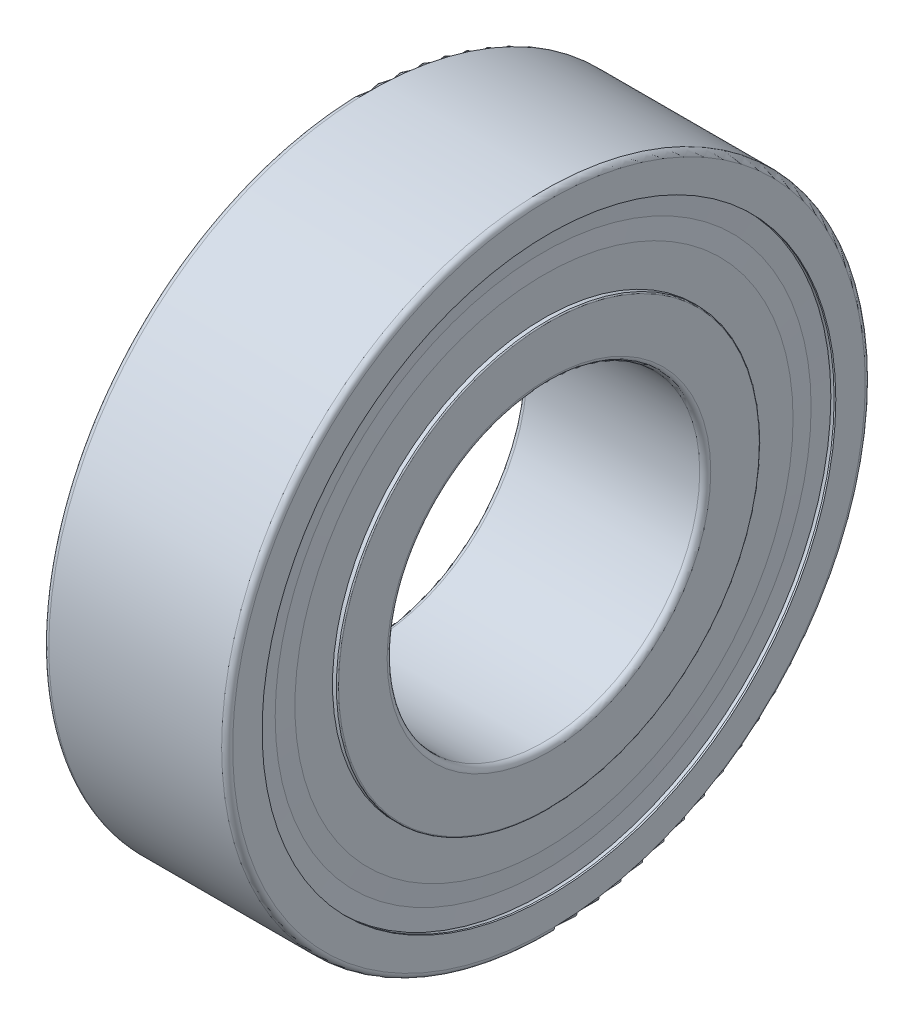
ISO-10303-21;
HEADER;
FILE_DESCRIPTION(('STEP AP214'),'2;1');
FILE_NAME('part.step','',(''),(''),'','','');
FILE_SCHEMA(('AUTOMOTIVE_DESIGN { 1 0 10303 214 1 1 1 1 }'));
ENDSEC;
DATA;
#1=APPLICATION_CONTEXT('core data for automotive mechanical design processes');
#2=APPLICATION_PROTOCOL_DEFINITION('international standard','automotive_design',2000,#1);
#3=PRODUCT_CONTEXT('',#1,'mechanical');
#4=PRODUCT('Part','Part','',(#3));
#5=PRODUCT_RELATED_PRODUCT_CATEGORY('part','',(#4));
#6=PRODUCT_DEFINITION_FORMATION('','',#4);
#7=PRODUCT_DEFINITION_CONTEXT('part definition',#1,'design');
#8=PRODUCT_DEFINITION('design','',#6,#7);
#9=PRODUCT_DEFINITION_SHAPE('','',#8);
#10=(LENGTH_UNIT() NAMED_UNIT(*) SI_UNIT(.MILLI.,.METRE.));
#11=(NAMED_UNIT(*) PLANE_ANGLE_UNIT() SI_UNIT($,.RADIAN.));
#12=(NAMED_UNIT(*) SI_UNIT($,.STERADIAN.) SOLID_ANGLE_UNIT());
#13=UNCERTAINTY_MEASURE_WITH_UNIT(LENGTH_MEASURE(1.E-05),#10,'distance_accuracy_value','');
#14=(GEOMETRIC_REPRESENTATION_CONTEXT(3) GLOBAL_UNCERTAINTY_ASSIGNED_CONTEXT((#13)) GLOBAL_UNIT_ASSIGNED_CONTEXT((#10,
#11,#12)) REPRESENTATION_CONTEXT('',''));
#15=CARTESIAN_POINT('',(0.,0.,0.));
#16=DIRECTION('',(0.,0.,1.));
#17=DIRECTION('',(1.,0.,0.));
#18=AXIS2_PLACEMENT_3D('',#15,#16,#17);
#19=CARTESIAN_POINT('',(50.,0.,0.));
#20=DIRECTION('',(1.,0.,0.));
#21=DIRECTION('',(0.,0.,-1.));
#22=AXIS2_PLACEMENT_3D('',#19,#20,#21);
#23=CYLINDRICAL_SURFACE('',#22,15.6);
#24=CARTESIAN_POINT('',(9.73,0.,0.));
#25=DIRECTION('',(1.,0.,0.));
#26=DIRECTION('',(0.,0.,-1.));
#27=AXIS2_PLACEMENT_3D('',#24,#25,#26);
#28=CIRCLE('',#27,15.6);
#29=CARTESIAN_POINT('',(9.73,0.,-15.6));
#30=VERTEX_POINT('',#29);
#31=EDGE_CURVE('P0_E10',#30,#30,#28,.T.);
#32=ORIENTED_EDGE('',*,*,#31,.F.);
#33=EDGE_LOOP('',(#32));
#34=FACE_BOUND('',#33,.T.);
#35=CARTESIAN_POINT('',(9.64,0.,0.));
#36=DIRECTION('',(1.,0.,0.));
#37=DIRECTION('',(0.,0.,-1.));
#38=AXIS2_PLACEMENT_3D('',#35,#36,#37);
#39=CIRCLE('',#38,15.6);
#40=CARTESIAN_POINT('',(9.64,0.,-15.6));
#41=VERTEX_POINT('',#40);
#42=EDGE_CURVE('P0_E167',#41,#41,#39,.T.);
#43=ORIENTED_EDGE('',*,*,#42,.T.);
#44=EDGE_LOOP('',(#43));
#45=FACE_BOUND('',#44,.T.);
#46=ADVANCED_FACE('P0_F16',(#34,#45),#23,.T.);
#47=CARTESIAN_POINT('',(9.685,0.,0.));
#48=DIRECTION('',(1.,0.,0.));
#49=DIRECTION('',(0.,0.,-1.));
#50=AXIS2_PLACEMENT_3D('',#47,#48,#49);
#51=CONICAL_SURFACE('',#50,14.5725,1.52702867499964);
#52=CARTESIAN_POINT('',(9.685,0.,0.));
#53=DIRECTION('',(1.,0.,0.));
#54=DIRECTION('',(0.,0.,-1.));
#55=AXIS2_PLACEMENT_3D('',#52,#53,#54);
#56=CIRCLE('',#55,14.5725);
#57=CARTESIAN_POINT('',(9.685,0.,-14.5725));
#58=VERTEX_POINT('',#57);
#59=EDGE_CURVE('P0_E26',#58,#58,#56,.T.);
#60=ORIENTED_EDGE('',*,*,#59,.F.);
#61=EDGE_LOOP('',(#60));
#62=FACE_BOUND('',#61,.T.);
#63=ORIENTED_EDGE('',*,*,#31,.T.);
#64=EDGE_LOOP('',(#63));
#65=FACE_BOUND('',#64,.T.);
#66=ADVANCED_FACE('P0_F204',(#62,#65),#51,.F.);
#67=CARTESIAN_POINT('',(9.73,0.,0.));
#68=DIRECTION('',(-1.,0.,0.));
#69=DIRECTION('',(0.,0.,1.));
#70=AXIS2_PLACEMENT_3D('',#67,#68,#69);
#71=CONICAL_SURFACE('',#70,13.545,1.52702867499964);
#72=CARTESIAN_POINT('',(9.73,0.,0.));
#73=DIRECTION('',(1.,0.,0.));
#74=DIRECTION('',(0.,0.,-1.));
#75=AXIS2_PLACEMENT_3D('',#72,#73,#74);
#76=CIRCLE('',#75,13.545);
#77=CARTESIAN_POINT('',(9.73,0.,-13.545));
#78=VERTEX_POINT('',#77);
#79=EDGE_CURVE('P0_E143',#78,#78,#76,.T.);
#80=ORIENTED_EDGE('',*,*,#79,.F.);
#81=EDGE_LOOP('',(#80));
#82=FACE_BOUND('',#81,.T.);
#83=ORIENTED_EDGE('',*,*,#59,.T.);
#84=EDGE_LOOP('',(#83));
#85=FACE_BOUND('',#84,.T.);
#86=ADVANCED_FACE('P0_F201',(#82,#85),#71,.T.);
#87=CARTESIAN_POINT('',(9.73,11.49,0.));
#88=DIRECTION('',(1.,0.,0.));
#89=DIRECTION('',(0.,1.,0.));
#90=AXIS2_PLACEMENT_3D('',#87,#88,#89);
#91=PLANE('',#90);
#92=CARTESIAN_POINT('',(9.73,0.,0.));
#93=DIRECTION('',(-1.,0.,0.));
#94=DIRECTION('',(0.,0.,-1.));
#95=AXIS2_PLACEMENT_3D('',#92,#93,#94);
#96=CIRCLE('',#95,11.5);
#97=CARTESIAN_POINT('',(9.73,0.,-11.5));
#98=VERTEX_POINT('',#97);
#99=EDGE_CURVE('P0_E148',#98,#98,#96,.T.);
#100=ORIENTED_EDGE('',*,*,#99,.T.);
#101=EDGE_LOOP('',(#100));
#102=FACE_BOUND('',#101,.T.);
#103=ORIENTED_EDGE('',*,*,#79,.T.);
#104=EDGE_LOOP('',(#103));
#105=FACE_BOUND('',#104,.T.);
#106=ADVANCED_FACE('P0_F199',(#102,#105),#91,.T.);
#107=CARTESIAN_POINT('',(9.55,0.,0.));
#108=DIRECTION('',(-1.,0.,0.));
#109=DIRECTION('',(0.,0.,1.));
#110=AXIS2_PLACEMENT_3D('',#107,#108,#109);
#111=CONICAL_SURFACE('',#110,13.545,1.52702867499964);
#112=CARTESIAN_POINT('',(9.55,0.,0.));
#113=DIRECTION('',(1.,0.,0.));
#114=DIRECTION('',(0.,0.,-1.));
#115=AXIS2_PLACEMENT_3D('',#112,#113,#114);
#116=CIRCLE('',#115,13.545);
#117=CARTESIAN_POINT('',(9.55,0.,-13.545));
#118=VERTEX_POINT('',#117);
#119=EDGE_CURVE('P0_E170',#118,#118,#116,.T.);
#120=ORIENTED_EDGE('',*,*,#119,.F.);
#121=EDGE_LOOP('',(#120));
#122=FACE_BOUND('',#121,.T.);
#123=CARTESIAN_POINT('',(9.63956204379562,0.,0.));
#124=DIRECTION('',(1.,0.,0.));
#125=DIRECTION('',(0.,0.,1.));
#126=AXIS2_PLACEMENT_3D('',#123,#124,#125);
#127=CIRCLE('',#126,11.5);
#128=CARTESIAN_POINT('',(9.63956204379562,0.,11.5));
#129=VERTEX_POINT('',#128);
#130=EDGE_CURVE('P0_E124',#129,#129,#127,.T.);
#131=ORIENTED_EDGE('',*,*,#130,.T.);
#132=EDGE_LOOP('',(#131));
#133=FACE_BOUND('',#132,.T.);
#134=ADVANCED_FACE('P0_F18',(#122,#133),#111,.F.);
#135=CARTESIAN_POINT('',(9.55,14.5725,0.));
#136=DIRECTION('',(-1.,0.,0.));
#137=DIRECTION('',(0.,0.,1.));
#138=AXIS2_PLACEMENT_3D('',#135,#136,#137);
#139=PLANE('',#138);
#140=CARTESIAN_POINT('',(9.55,0.,0.));
#141=DIRECTION('',(1.,0.,0.));
#142=DIRECTION('',(0.,0.,-1.));
#143=AXIS2_PLACEMENT_3D('',#140,#141,#142);
#144=CIRCLE('',#143,14.5725);
#145=CARTESIAN_POINT('',(9.55,0.,-14.5725));
#146=VERTEX_POINT('',#145);
#147=EDGE_CURVE('P0_E166',#146,#146,#144,.T.);
#148=ORIENTED_EDGE('',*,*,#147,.F.);
#149=EDGE_LOOP('',(#148));
#150=FACE_BOUND('',#149,.T.);
#151=ORIENTED_EDGE('',*,*,#119,.T.);
#152=EDGE_LOOP('',(#151));
#153=FACE_BOUND('',#152,.T.);
#154=ADVANCED_FACE('P0_F246',(#150,#153),#139,.T.);
#155=CARTESIAN_POINT('',(9.64,0.,0.));
#156=DIRECTION('',(1.,0.,0.));
#157=DIRECTION('',(0.,0.,-1.));
#158=AXIS2_PLACEMENT_3D('',#155,#156,#157);
#159=CONICAL_SURFACE('',#158,15.6,1.48342806694239);
#160=ORIENTED_EDGE('',*,*,#42,.F.);
#161=EDGE_LOOP('',(#160));
#162=FACE_BOUND('',#161,.T.);
#163=ORIENTED_EDGE('',*,*,#147,.T.);
#164=EDGE_LOOP('',(#163));
#165=FACE_BOUND('',#164,.T.);
#166=ADVANCED_FACE('P0_F248',(#162,#165),#159,.T.);
#167=CARTESIAN_POINT('',(0.45,0.,0.));
#168=DIRECTION('',(-1.,0.,0.));
#169=DIRECTION('',(0.,0.,1.));
#170=AXIS2_PLACEMENT_3D('',#167,#168,#169);
#171=CONICAL_SURFACE('',#170,14.5725,1.48342806694239);
#172=CARTESIAN_POINT('',(0.45,0.,0.));
#173=DIRECTION('',(1.,0.,0.));
#174=DIRECTION('',(0.,0.,-1.));
#175=AXIS2_PLACEMENT_3D('',#172,#173,#174);
#176=CIRCLE('',#175,14.5725);
#177=CARTESIAN_POINT('',(0.45,0.,-14.5725));
#178=VERTEX_POINT('',#177);
#179=EDGE_CURVE('P0_E163',#178,#178,#176,.T.);
#180=ORIENTED_EDGE('',*,*,#179,.F.);
#181=EDGE_LOOP('',(#180));
#182=FACE_BOUND('',#181,.T.);
#183=CARTESIAN_POINT('',(0.36,0.,0.));
#184=DIRECTION('',(1.,0.,0.));
#185=DIRECTION('',(0.,0.,-1.));
#186=AXIS2_PLACEMENT_3D('',#183,#184,#185);
#187=CIRCLE('',#186,15.6);
#188=CARTESIAN_POINT('',(0.36,0.,-15.6));
#189=VERTEX_POINT('',#188);
#190=EDGE_CURVE('P0_E140',#189,#189,#187,.T.);
#191=ORIENTED_EDGE('',*,*,#190,.T.);
#192=EDGE_LOOP('',(#191));
#193=FACE_BOUND('',#192,.T.);
#194=ADVANCED_FACE('P0_F254',(#182,#193),#171,.T.);
#195=CARTESIAN_POINT('',(0.45,13.545,0.));
#196=DIRECTION('',(1.,0.,0.));
#197=DIRECTION('',(0.,1.,0.));
#198=AXIS2_PLACEMENT_3D('',#195,#196,#197);
#199=PLANE('',#198);
#200=CARTESIAN_POINT('',(0.45,0.,0.));
#201=DIRECTION('',(1.,0.,0.));
#202=DIRECTION('',(0.,0.,-1.));
#203=AXIS2_PLACEMENT_3D('',#200,#201,#202);
#204=CIRCLE('',#203,13.545);
#205=CARTESIAN_POINT('',(0.45,0.,-13.545));
#206=VERTEX_POINT('',#205);
#207=EDGE_CURVE('P0_E156',#206,#206,#204,.T.);
#208=ORIENTED_EDGE('',*,*,#207,.F.);
#209=EDGE_LOOP('',(#208));
#210=FACE_BOUND('',#209,.T.);
#211=ORIENTED_EDGE('',*,*,#179,.T.);
#212=EDGE_LOOP('',(#211));
#213=FACE_BOUND('',#212,.T.);
#214=ADVANCED_FACE('P0_F251',(#210,#213),#199,.T.);
#215=CARTESIAN_POINT('',(0.36,0.,0.));
#216=DIRECTION('',(1.,0.,0.));
#217=DIRECTION('',(0.,0.,-1.));
#218=AXIS2_PLACEMENT_3D('',#215,#216,#217);
#219=CONICAL_SURFACE('',#218,11.49,1.52702867499964);
#220=CARTESIAN_POINT('',(0.360437956204379,0.,0.));
#221=DIRECTION('',(-1.,0.,0.));
#222=DIRECTION('',(0.,0.,-1.));
#223=AXIS2_PLACEMENT_3D('',#220,#221,#222);
#224=CIRCLE('',#223,11.5);
#225=CARTESIAN_POINT('',(0.360437956204379,0.,-11.5));
#226=VERTEX_POINT('',#225);
#227=EDGE_CURVE('P0_E147',#226,#226,#224,.T.);
#228=ORIENTED_EDGE('',*,*,#227,.T.);
#229=EDGE_LOOP('',(#228));
#230=FACE_BOUND('',#229,.T.);
#231=ORIENTED_EDGE('',*,*,#207,.T.);
#232=EDGE_LOOP('',(#231));
#233=FACE_BOUND('',#232,.T.);
#234=ADVANCED_FACE('P0_F233',(#230,#233),#219,.F.);
#235=CARTESIAN_POINT('',(0.27,13.545,0.));
#236=DIRECTION('',(-1.,0.,0.));
#237=DIRECTION('',(0.,0.,1.));
#238=AXIS2_PLACEMENT_3D('',#235,#236,#237);
#239=PLANE('',#238);
#240=CARTESIAN_POINT('',(0.27,0.,0.));
#241=DIRECTION('',(1.,0.,0.));
#242=DIRECTION('',(0.,0.,-1.));
#243=AXIS2_PLACEMENT_3D('',#240,#241,#242);
#244=CIRCLE('',#243,13.545);
#245=CARTESIAN_POINT('',(0.27,0.,-13.545));
#246=VERTEX_POINT('',#245);
#247=EDGE_CURVE('P0_E139',#246,#246,#244,.T.);
#248=ORIENTED_EDGE('',*,*,#247,.F.);
#249=EDGE_LOOP('',(#248));
#250=FACE_BOUND('',#249,.T.);
#251=CARTESIAN_POINT('',(0.27,0.,0.));
#252=DIRECTION('',(1.,0.,0.));
#253=DIRECTION('',(0.,0.,1.));
#254=AXIS2_PLACEMENT_3D('',#251,#252,#253);
#255=CIRCLE('',#254,11.5);
#256=CARTESIAN_POINT('',(0.27,0.,11.5));
#257=VERTEX_POINT('',#256);
#258=EDGE_CURVE('P0_E149',#257,#257,#255,.T.);
#259=ORIENTED_EDGE('',*,*,#258,.T.);
#260=EDGE_LOOP('',(#259));
#261=FACE_BOUND('',#260,.T.);
#262=ADVANCED_FACE('P0_F229',(#250,#261),#239,.T.);
#263=CARTESIAN_POINT('',(0.315,0.,0.));
#264=DIRECTION('',(1.,0.,0.));
#265=DIRECTION('',(0.,0.,-1.));
#266=AXIS2_PLACEMENT_3D('',#263,#264,#265);
#267=CONICAL_SURFACE('',#266,14.5725,1.52702867499964);
#268=CARTESIAN_POINT('',(0.315,0.,0.));
#269=DIRECTION('',(1.,0.,0.));
#270=DIRECTION('',(0.,0.,-1.));
#271=AXIS2_PLACEMENT_3D('',#268,#269,#270);
#272=CIRCLE('',#271,14.5725);
#273=CARTESIAN_POINT('',(0.315,0.,-14.5725));
#274=VERTEX_POINT('',#273);
#275=EDGE_CURVE('P0_E136',#274,#274,#272,.T.);
#276=ORIENTED_EDGE('',*,*,#275,.F.);
#277=EDGE_LOOP('',(#276));
#278=FACE_BOUND('',#277,.T.);
#279=ORIENTED_EDGE('',*,*,#247,.T.);
#280=EDGE_LOOP('',(#279));
#281=FACE_BOUND('',#280,.T.);
#282=ADVANCED_FACE('P0_F232',(#278,#281),#267,.T.);
#283=CARTESIAN_POINT('',(0.27,0.,0.));
#284=DIRECTION('',(-1.,0.,0.));
#285=DIRECTION('',(0.,0.,1.));
#286=AXIS2_PLACEMENT_3D('',#283,#284,#285);
#287=CONICAL_SURFACE('',#286,15.6,1.52702867499964);
#288=CARTESIAN_POINT('',(0.27,0.,0.));
#289=DIRECTION('',(1.,0.,0.));
#290=DIRECTION('',(0.,0.,-1.));
#291=AXIS2_PLACEMENT_3D('',#288,#289,#290);
#292=CIRCLE('',#291,15.6);
#293=CARTESIAN_POINT('',(0.27,0.,-15.6));
#294=VERTEX_POINT('',#293);
#295=EDGE_CURVE('P0_E184',#294,#294,#292,.T.);
#296=ORIENTED_EDGE('',*,*,#295,.F.);
#297=EDGE_LOOP('',(#296));
#298=FACE_BOUND('',#297,.T.);
#299=ORIENTED_EDGE('',*,*,#275,.T.);
#300=EDGE_LOOP('',(#299));
#301=FACE_BOUND('',#300,.T.);
#302=ADVANCED_FACE('P0_F244',(#298,#301),#287,.F.);
#303=CARTESIAN_POINT('',(50.,0.,0.));
#304=DIRECTION('',(1.,0.,0.));
#305=DIRECTION('',(0.,0.,-1.));
#306=AXIS2_PLACEMENT_3D('',#303,#304,#305);
#307=CYLINDRICAL_SURFACE('',#306,15.6);
#308=ORIENTED_EDGE('',*,*,#190,.F.);
#309=EDGE_LOOP('',(#308));
#310=FACE_BOUND('',#309,.T.);
#311=ORIENTED_EDGE('',*,*,#295,.T.);
#312=EDGE_LOOP('',(#311));
#313=FACE_BOUND('',#312,.T.);
#314=ADVANCED_FACE('P0_F273',(#310,#313),#307,.T.);
#315=CARTESIAN_POINT('',(50.,0.,0.));
#316=DIRECTION('',(1.,0.,0.));
#317=DIRECTION('',(0.,0.,-1.));
#318=AXIS2_PLACEMENT_3D('',#315,#316,#317);
#319=CYLINDRICAL_SURFACE('',#318,11.5);
#320=CARTESIAN_POINT('',(3.15090265264373,0.,0.));
#321=DIRECTION('',(1.,0.,0.));
#322=DIRECTION('',(0.,0.,-1.));
#323=AXIS2_PLACEMENT_3D('',#320,#321,#322);
#324=CIRCLE('',#323,11.5);
#325=CARTESIAN_POINT('',(3.15090265264373,0.,-11.5));
#326=VERTEX_POINT('',#325);
#327=EDGE_CURVE('P0_E144',#326,#326,#324,.T.);
#328=ORIENTED_EDGE('',*,*,#327,.F.);
#329=EDGE_LOOP('',(#328));
#330=FACE_BOUND('',#329,.T.);
#331=ORIENTED_EDGE('',*,*,#227,.F.);
#332=EDGE_LOOP('',(#331));
#333=FACE_BOUND('',#332,.T.);
#334=ADVANCED_FACE('P0_F275',(#330,#333),#319,.T.);
#335=CARTESIAN_POINT('',(5.,0.,0.));
#336=DIRECTION('',(1.,0.,0.));
#337=DIRECTION('',(0.,0.,-1.));
#338=AXIS2_PLACEMENT_3D('',#335,#336,#337);
#339=TOROIDAL_SURFACE('',#338,13.,2.381);
#340=ORIENTED_EDGE('',*,*,#327,.T.);
#341=EDGE_LOOP('',(#340));
#342=FACE_BOUND('',#341,.T.);
#343=CARTESIAN_POINT('',(6.84909734735627,0.,0.));
#344=DIRECTION('',(1.,0.,0.));
#345=DIRECTION('',(0.,0.,-1.));
#346=AXIS2_PLACEMENT_3D('',#343,#344,#345);
#347=CIRCLE('',#346,11.5);
#348=CARTESIAN_POINT('',(6.84909734735627,0.,-11.5));
#349=VERTEX_POINT('',#348);
#350=EDGE_CURVE('P0_E120',#349,#349,#347,.T.);
#351=ORIENTED_EDGE('',*,*,#350,.F.);
#352=EDGE_LOOP('',(#351));
#353=FACE_BOUND('',#352,.T.);
#354=ADVANCED_FACE('P0_F271',(#342,#353),#339,.F.);
#355=CARTESIAN_POINT('',(50.,0.,0.));
#356=DIRECTION('',(1.,0.,0.));
#357=DIRECTION('',(0.,0.,-1.));
#358=AXIS2_PLACEMENT_3D('',#355,#356,#357);
#359=CYLINDRICAL_SURFACE('',#358,11.5);
#360=CARTESIAN_POINT('',(9.94,0.,0.));
#361=DIRECTION('',(1.,0.,0.));
#362=DIRECTION('',(0.,0.,-1.));
#363=AXIS2_PLACEMENT_3D('',#360,#361,#362);
#364=CIRCLE('',#363,11.5);
#365=CARTESIAN_POINT('',(9.94,0.,-11.5));
#366=VERTEX_POINT('',#365);
#367=EDGE_CURVE('P0_E174',#366,#366,#364,.T.);
#368=ORIENTED_EDGE('',*,*,#367,.F.);
#369=EDGE_LOOP('',(#368));
#370=FACE_BOUND('',#369,.T.);
#371=ORIENTED_EDGE('',*,*,#99,.F.);
#372=EDGE_LOOP('',(#371));
#373=FACE_BOUND('',#372,.T.);
#374=ADVANCED_FACE('P0_F237',(#370,#373),#359,.T.);
#375=CARTESIAN_POINT('',(9.94,0.,0.));
#376=DIRECTION('',(1.,0.,0.));
#377=DIRECTION('',(0.,0.,-1.));
#378=AXIS2_PLACEMENT_3D('',#375,#376,#377);
#379=TOROIDAL_SURFACE('',#378,11.44,0.0599999999999976);
#380=CARTESIAN_POINT('',(10.,0.,0.));
#381=DIRECTION('',(1.,0.,0.));
#382=DIRECTION('',(0.,0.,-1.));
#383=AXIS2_PLACEMENT_3D('',#380,#381,#382);
#384=CIRCLE('',#383,11.44);
#385=CARTESIAN_POINT('',(10.,0.,-11.44));
#386=VERTEX_POINT('',#385);
#387=EDGE_CURVE('P0_E161',#386,#386,#384,.T.);
#388=ORIENTED_EDGE('',*,*,#387,.F.);
#389=EDGE_LOOP('',(#388));
#390=FACE_BOUND('',#389,.T.);
#391=ORIENTED_EDGE('',*,*,#367,.T.);
#392=EDGE_LOOP('',(#391));
#393=FACE_BOUND('',#392,.T.);
#394=ADVANCED_FACE('P0_F221',(#390,#393),#379,.T.);
#395=CARTESIAN_POINT('',(10.,8.8,0.));
#396=DIRECTION('',(1.,0.,0.));
#397=DIRECTION('',(0.,1.,0.));
#398=AXIS2_PLACEMENT_3D('',#395,#396,#397);
#399=PLANE('',#398);
#400=CARTESIAN_POINT('',(10.,0.,0.));
#401=DIRECTION('',(1.,0.,0.));
#402=DIRECTION('',(0.,0.,-1.));
#403=AXIS2_PLACEMENT_3D('',#400,#401,#402);
#404=CIRCLE('',#403,8.8);
#405=CARTESIAN_POINT('',(10.,0.,-8.8));
#406=VERTEX_POINT('',#405);
#407=EDGE_CURVE('P0_E157',#406,#406,#404,.T.);
#408=ORIENTED_EDGE('',*,*,#407,.F.);
#409=EDGE_LOOP('',(#408));
#410=FACE_BOUND('',#409,.T.);
#411=ORIENTED_EDGE('',*,*,#387,.T.);
#412=EDGE_LOOP('',(#411));
#413=FACE_BOUND('',#412,.T.);
#414=ADVANCED_FACE('P0_F217',(#410,#413),#399,.T.);
#415=CARTESIAN_POINT('',(9.7,0.,0.));
#416=DIRECTION('',(1.,0.,0.));
#417=DIRECTION('',(0.,0.,-1.));
#418=AXIS2_PLACEMENT_3D('',#415,#416,#417);
#419=TOROIDAL_SURFACE('',#418,8.8,0.300000000000005);
#420=CARTESIAN_POINT('',(9.7,0.,0.));
#421=DIRECTION('',(1.,0.,0.));
#422=DIRECTION('',(0.,0.,-1.));
#423=AXIS2_PLACEMENT_3D('',#420,#421,#422);
#424=CIRCLE('',#423,8.5);
#425=CARTESIAN_POINT('',(9.7,0.,-8.5));
#426=VERTEX_POINT('',#425);
#427=EDGE_CURVE('P0_E162',#426,#426,#424,.T.);
#428=ORIENTED_EDGE('',*,*,#427,.F.);
#429=EDGE_LOOP('',(#428));
#430=FACE_BOUND('',#429,.T.);
#431=ORIENTED_EDGE('',*,*,#407,.T.);
#432=EDGE_LOOP('',(#431));
#433=FACE_BOUND('',#432,.T.);
#434=ADVANCED_FACE('P0_F220',(#430,#433),#419,.T.);
#435=CARTESIAN_POINT('',(50.,0.,0.));
#436=DIRECTION('',(1.,0.,0.));
#437=DIRECTION('',(0.,0.,-1.));
#438=AXIS2_PLACEMENT_3D('',#435,#436,#437);
#439=CYLINDRICAL_SURFACE('',#438,8.5);
#440=CARTESIAN_POINT('',(0.3,0.,0.));
#441=DIRECTION('',(1.,0.,0.));
#442=DIRECTION('',(0.,0.,-1.));
#443=AXIS2_PLACEMENT_3D('',#440,#441,#442);
#444=CIRCLE('',#443,8.5);
#445=CARTESIAN_POINT('',(0.3,0.,-8.5));
#446=VERTEX_POINT('',#445);
#447=EDGE_CURVE('P0_E183',#446,#446,#444,.T.);
#448=ORIENTED_EDGE('',*,*,#447,.F.);
#449=EDGE_LOOP('',(#448));
#450=FACE_BOUND('',#449,.T.);
#451=ORIENTED_EDGE('',*,*,#427,.T.);
#452=EDGE_LOOP('',(#451));
#453=FACE_BOUND('',#452,.T.);
#454=ADVANCED_FACE('P0_F227',(#450,#453),#439,.F.);
#455=CARTESIAN_POINT('',(0.3,0.,0.));
#456=DIRECTION('',(1.,0.,0.));
#457=DIRECTION('',(0.,0.,-1.));
#458=AXIS2_PLACEMENT_3D('',#455,#456,#457);
#459=TOROIDAL_SURFACE('',#458,8.8,0.3);
#460=CARTESIAN_POINT('',(0.,0.,0.));
#461=DIRECTION('',(1.,0.,0.));
#462=DIRECTION('',(0.,0.,-1.));
#463=AXIS2_PLACEMENT_3D('',#460,#461,#462);
#464=CIRCLE('',#463,8.8);
#465=CARTESIAN_POINT('',(0.,0.,-8.8));
#466=VERTEX_POINT('',#465);
#467=EDGE_CURVE('P0_E190',#466,#466,#464,.T.);
#468=ORIENTED_EDGE('',*,*,#467,.F.);
#469=EDGE_LOOP('',(#468));
#470=FACE_BOUND('',#469,.T.);
#471=ORIENTED_EDGE('',*,*,#447,.T.);
#472=EDGE_LOOP('',(#471));
#473=FACE_BOUND('',#472,.T.);
#474=ADVANCED_FACE('P0_F223',(#470,#473),#459,.T.);
#475=CARTESIAN_POINT('',(0.,11.44,0.));
#476=DIRECTION('',(-1.,0.,0.));
#477=DIRECTION('',(0.,0.,1.));
#478=AXIS2_PLACEMENT_3D('',#475,#476,#477);
#479=PLANE('',#478);
#480=CARTESIAN_POINT('',(0.,0.,0.));
#481=DIRECTION('',(1.,0.,0.));
#482=DIRECTION('',(0.,0.,-1.));
#483=AXIS2_PLACEMENT_3D('',#480,#481,#482);
#484=CIRCLE('',#483,11.44);
#485=CARTESIAN_POINT('',(0.,0.,-11.44));
#486=VERTEX_POINT('',#485);
#487=EDGE_CURVE('P0_E134',#486,#486,#484,.T.);
#488=ORIENTED_EDGE('',*,*,#487,.F.);
#489=EDGE_LOOP('',(#488));
#490=FACE_BOUND('',#489,.T.);
#491=ORIENTED_EDGE('',*,*,#467,.T.);
#492=EDGE_LOOP('',(#491));
#493=FACE_BOUND('',#492,.T.);
#494=ADVANCED_FACE('P0_F226',(#490,#493),#479,.T.);
#495=CARTESIAN_POINT('',(0.0599999999999987,0.,0.));
#496=DIRECTION('',(1.,0.,0.));
#497=DIRECTION('',(0.,0.,-1.));
#498=AXIS2_PLACEMENT_3D('',#495,#496,#497);
#499=TOROIDAL_SURFACE('',#498,11.44,0.0599999999999993);
#500=CARTESIAN_POINT('',(0.0599999999999976,0.,0.));
#501=DIRECTION('',(1.,0.,0.));
#502=DIRECTION('',(0.,0.,-1.));
#503=AXIS2_PLACEMENT_3D('',#500,#501,#502);
#504=CIRCLE('',#503,11.5);
#505=CARTESIAN_POINT('',(0.0599999999999976,0.,-11.5));
#506=VERTEX_POINT('',#505);
#507=EDGE_CURVE('P0_E130',#506,#506,#504,.T.);
#508=ORIENTED_EDGE('',*,*,#507,.F.);
#509=EDGE_LOOP('',(#508));
#510=FACE_BOUND('',#509,.T.);
#511=ORIENTED_EDGE('',*,*,#487,.T.);
#512=EDGE_LOOP('',(#511));
#513=FACE_BOUND('',#512,.T.);
#514=ADVANCED_FACE('P0_F278',(#510,#513),#499,.T.);
#515=CARTESIAN_POINT('',(50.,0.,0.));
#516=DIRECTION('',(1.,0.,0.));
#517=DIRECTION('',(0.,0.,-1.));
#518=AXIS2_PLACEMENT_3D('',#515,#516,#517);
#519=CYLINDRICAL_SURFACE('',#518,11.5);
#520=ORIENTED_EDGE('',*,*,#258,.F.);
#521=EDGE_LOOP('',(#520));
#522=FACE_BOUND('',#521,.T.);
#523=ORIENTED_EDGE('',*,*,#507,.T.);
#524=EDGE_LOOP('',(#523));
#525=FACE_BOUND('',#524,.T.);
#526=ADVANCED_FACE('P0_F264',(#522,#525),#519,.T.);
#527=CARTESIAN_POINT('',(50.,0.,0.));
#528=DIRECTION('',(1.,0.,0.));
#529=DIRECTION('',(0.,0.,-1.));
#530=AXIS2_PLACEMENT_3D('',#527,#528,#529);
#531=CYLINDRICAL_SURFACE('',#530,11.5);
#532=ORIENTED_EDGE('',*,*,#130,.F.);
#533=EDGE_LOOP('',(#532));
#534=FACE_BOUND('',#533,.T.);
#535=ORIENTED_EDGE('',*,*,#350,.T.);
#536=EDGE_LOOP('',(#535));
#537=FACE_BOUND('',#536,.T.);
#538=ADVANCED_FACE('P0_F121',(#534,#537),#531,.T.);
#539=CLOSED_SHELL('',(#46,#66,#86,#106,#134,#154,#166,#194,#214,#234,#262,#282,#302,#314,#334,
#354,#374,#394,#414,#434,#454,#474,#494,#514,#526,#538));
#540=MANIFOLD_SOLID_BREP('P0_B1',#539);
#541=CARTESIAN_POINT('',(50.,0.,0.));
#542=DIRECTION('',(1.,0.,0.));
#543=DIRECTION('',(0.,0.,-1.));
#544=AXIS2_PLACEMENT_3D('',#541,#542,#543);
#545=CYLINDRICAL_SURFACE('',#544,17.5);
#546=CARTESIAN_POINT('',(9.7,0.,0.));
#547=DIRECTION('',(1.,0.,0.));
#548=DIRECTION('',(0.,0.,-1.));
#549=AXIS2_PLACEMENT_3D('',#546,#547,#548);
#550=CIRCLE('',#549,17.5);
#551=CARTESIAN_POINT('',(9.7,0.,-17.5));
#552=VERTEX_POINT('',#551);
#553=EDGE_CURVE('P1_E11',#552,#552,#550,.T.);
#554=ORIENTED_EDGE('',*,*,#553,.F.);
#555=EDGE_LOOP('',(#554));
#556=FACE_BOUND('',#555,.T.);
#557=CARTESIAN_POINT('',(0.3,0.,0.));
#558=DIRECTION('',(1.,0.,0.));
#559=DIRECTION('',(0.,0.,-1.));
#560=AXIS2_PLACEMENT_3D('',#557,#558,#559);
#561=CIRCLE('',#560,17.5);
#562=CARTESIAN_POINT('',(0.3,0.,-17.5));
#563=VERTEX_POINT('',#562);
#564=EDGE_CURVE('P1_E104',#563,#563,#561,.T.);
#565=ORIENTED_EDGE('',*,*,#564,.T.);
#566=EDGE_LOOP('',(#565));
#567=FACE_BOUND('',#566,.T.);
#568=ADVANCED_FACE('P1_F17',(#556,#567),#545,.T.);
#569=CARTESIAN_POINT('',(9.7,0.,0.));
#570=DIRECTION('',(1.,0.,0.));
#571=DIRECTION('',(0.,0.,-1.));
#572=AXIS2_PLACEMENT_3D('',#569,#570,#571);
#573=TOROIDAL_SURFACE('',#572,17.2,0.3);
#574=CARTESIAN_POINT('',(10.,0.,0.));
#575=DIRECTION('',(1.,0.,0.));
#576=DIRECTION('',(0.,0.,-1.));
#577=AXIS2_PLACEMENT_3D('',#574,#575,#576);
#578=CIRCLE('',#577,17.2);
#579=CARTESIAN_POINT('',(10.,0.,-17.2));
#580=VERTEX_POINT('',#579);
#581=EDGE_CURVE('P1_E28',#580,#580,#578,.T.);
#582=ORIENTED_EDGE('',*,*,#581,.F.);
#583=EDGE_LOOP('',(#582));
#584=FACE_BOUND('',#583,.T.);
#585=ORIENTED_EDGE('',*,*,#553,.T.);
#586=EDGE_LOOP('',(#585));
#587=FACE_BOUND('',#586,.T.);
#588=ADVANCED_FACE('P1_F19',(#584,#587),#573,.T.);
#589=CARTESIAN_POINT('',(10.,15.6,0.));
#590=DIRECTION('',(1.,0.,0.));
#591=DIRECTION('',(0.,1.,0.));
#592=AXIS2_PLACEMENT_3D('',#589,#590,#591);
#593=PLANE('',#592);
#594=CARTESIAN_POINT('',(10.,0.,0.));
#595=DIRECTION('',(1.,0.,0.));
#596=DIRECTION('',(0.,0.,-1.));
#597=AXIS2_PLACEMENT_3D('',#594,#595,#596);
#598=CIRCLE('',#597,15.6);
#599=CARTESIAN_POINT('',(10.,0.,-15.6));
#600=VERTEX_POINT('',#599);
#601=EDGE_CURVE('P1_E88',#600,#600,#598,.T.);
#602=ORIENTED_EDGE('',*,*,#601,.F.);
#603=EDGE_LOOP('',(#602));
#604=FACE_BOUND('',#603,.T.);
#605=ORIENTED_EDGE('',*,*,#581,.T.);
#606=EDGE_LOOP('',(#605));
#607=FACE_BOUND('',#606,.T.);
#608=ADVANCED_FACE('P1_F156',(#604,#607),#593,.T.);
#609=CARTESIAN_POINT('',(50.,0.,0.));
#610=DIRECTION('',(1.,0.,0.));
#611=DIRECTION('',(0.,0.,-1.));
#612=AXIS2_PLACEMENT_3D('',#609,#610,#611);
#613=CYLINDRICAL_SURFACE('',#612,15.6);
#614=CARTESIAN_POINT('',(9.91,0.,0.));
#615=DIRECTION('',(1.,0.,0.));
#616=DIRECTION('',(0.,0.,-1.));
#617=AXIS2_PLACEMENT_3D('',#614,#615,#616);
#618=CIRCLE('',#617,15.6);
#619=CARTESIAN_POINT('',(9.91,0.,-15.6));
#620=VERTEX_POINT('',#619);
#621=EDGE_CURVE('P1_E92',#620,#620,#618,.T.);
#622=ORIENTED_EDGE('',*,*,#621,.F.);
#623=EDGE_LOOP('',(#622));
#624=FACE_BOUND('',#623,.T.);
#625=ORIENTED_EDGE('',*,*,#601,.T.);
#626=EDGE_LOOP('',(#625));
#627=FACE_BOUND('',#626,.T.);
#628=ADVANCED_FACE('P1_F89',(#624,#627),#613,.F.);
#629=CARTESIAN_POINT('',(9.73,0.,0.));
#630=DIRECTION('',(1.,0.,0.));
#631=DIRECTION('',(0.,0.,-1.));
#632=AXIS2_PLACEMENT_3D('',#629,#630,#631);
#633=TOROIDAL_SURFACE('',#632,15.6000000094977,0.18);
#634=ORIENTED_EDGE('',*,*,#621,.T.);
#635=EDGE_LOOP('',(#634));
#636=FACE_BOUND('',#635,.T.);
#637=CARTESIAN_POINT('',(9.55,0.,0.));
#638=DIRECTION('',(1.,0.,0.));
#639=DIRECTION('',(0.,0.,-1.));
#640=AXIS2_PLACEMENT_3D('',#637,#638,#639);
#641=CIRCLE('',#640,15.6);
#642=CARTESIAN_POINT('',(9.55,0.,-15.6));
#643=VERTEX_POINT('',#642);
#644=EDGE_CURVE('P1_E100',#643,#643,#641,.T.);
#645=ORIENTED_EDGE('',*,*,#644,.F.);
#646=EDGE_LOOP('',(#645));
#647=FACE_BOUND('',#646,.T.);
#648=ADVANCED_FACE('P1_F159',(#636,#647),#633,.F.);
#649=CARTESIAN_POINT('',(9.37367301929154,0.,0.));
#650=DIRECTION('',(1.,0.,0.));
#651=DIRECTION('',(0.,0.,-1.));
#652=AXIS2_PLACEMENT_3D('',#649,#650,#651);
#653=CONICAL_SURFACE('',#652,14.6,1.39626340159546);
#654=CARTESIAN_POINT('',(9.37367301929154,0.,0.));
#655=DIRECTION('',(1.,0.,0.));
#656=DIRECTION('',(0.,0.,-1.));
#657=AXIS2_PLACEMENT_3D('',#654,#655,#656);
#658=CIRCLE('',#657,14.6);
#659=CARTESIAN_POINT('',(9.37367301929154,0.,-14.6));
#660=VERTEX_POINT('',#659);
#661=EDGE_CURVE('P1_E21',#660,#660,#658,.T.);
#662=ORIENTED_EDGE('',*,*,#661,.F.);
#663=EDGE_LOOP('',(#662));
#664=FACE_BOUND('',#663,.T.);
#665=ORIENTED_EDGE('',*,*,#644,.T.);
#666=EDGE_LOOP('',(#665));
#667=FACE_BOUND('',#666,.T.);
#668=ADVANCED_FACE('P1_F162',(#664,#667),#653,.F.);
#669=CARTESIAN_POINT('',(50.,0.,0.));
#670=DIRECTION('',(1.,0.,0.));
#671=DIRECTION('',(0.,0.,-1.));
#672=AXIS2_PLACEMENT_3D('',#669,#670,#671);
#673=CYLINDRICAL_SURFACE('',#672,14.6);
#674=CARTESIAN_POINT('',(6.76328131618299,0.,0.));
#675=DIRECTION('',(1.,0.,0.));
#676=DIRECTION('',(0.,0.,-1.));
#677=AXIS2_PLACEMENT_3D('',#674,#675,#676);
#678=CIRCLE('',#677,14.6);
#679=CARTESIAN_POINT('',(6.76328131618299,0.,-14.6));
#680=VERTEX_POINT('',#679);
#681=EDGE_CURVE('P1_E120',#680,#680,#678,.T.);
#682=ORIENTED_EDGE('',*,*,#681,.F.);
#683=EDGE_LOOP('',(#682));
#684=FACE_BOUND('',#683,.T.);
#685=ORIENTED_EDGE('',*,*,#661,.T.);
#686=EDGE_LOOP('',(#685));
#687=FACE_BOUND('',#686,.T.);
#688=ADVANCED_FACE('P1_F170',(#684,#687),#673,.F.);
#689=CARTESIAN_POINT('',(5.,0.,0.));
#690=DIRECTION('',(1.,0.,0.));
#691=DIRECTION('',(0.,0.,-1.));
#692=AXIS2_PLACEMENT_3D('',#689,#690,#691);
#693=TOROIDAL_SURFACE('',#692,13.,2.381);
#694=ORIENTED_EDGE('',*,*,#681,.T.);
#695=EDGE_LOOP('',(#694));
#696=FACE_BOUND('',#695,.T.);
#697=CARTESIAN_POINT('',(3.23671868381702,0.,0.));
#698=DIRECTION('',(1.,0.,0.));
#699=DIRECTION('',(0.,0.,-1.));
#700=AXIS2_PLACEMENT_3D('',#697,#698,#699);
#701=CIRCLE('',#700,14.6);
#702=CARTESIAN_POINT('',(3.23671868381702,0.,-14.6));
#703=VERTEX_POINT('',#702);
#704=EDGE_CURVE('P1_E117',#703,#703,#701,.T.);
#705=ORIENTED_EDGE('',*,*,#704,.F.);
#706=EDGE_LOOP('',(#705));
#707=FACE_BOUND('',#706,.T.);
#708=ADVANCED_FACE('P1_F182',(#696,#707),#693,.F.);
#709=CARTESIAN_POINT('',(50.,0.,0.));
#710=DIRECTION('',(1.,0.,0.));
#711=DIRECTION('',(0.,0.,-1.));
#712=AXIS2_PLACEMENT_3D('',#709,#710,#711);
#713=CYLINDRICAL_SURFACE('',#712,14.6);
#714=CARTESIAN_POINT('',(0.626326980708462,0.,0.));
#715=DIRECTION('',(1.,0.,0.));
#716=DIRECTION('',(0.,0.,-1.));
#717=AXIS2_PLACEMENT_3D('',#714,#715,#716);
#718=CIRCLE('',#717,14.6);
#719=CARTESIAN_POINT('',(0.626326980708462,0.,-14.6));
#720=VERTEX_POINT('',#719);
#721=EDGE_CURVE('P1_E113',#720,#720,#718,.T.);
#722=ORIENTED_EDGE('',*,*,#721,.F.);
#723=EDGE_LOOP('',(#722));
#724=FACE_BOUND('',#723,.T.);
#725=ORIENTED_EDGE('',*,*,#704,.T.);
#726=EDGE_LOOP('',(#725));
#727=FACE_BOUND('',#726,.T.);
#728=ADVANCED_FACE('P1_F179',(#724,#727),#713,.F.);
#729=CARTESIAN_POINT('',(0.45,0.,0.));
#730=DIRECTION('',(-1.,0.,0.));
#731=DIRECTION('',(0.,0.,1.));
#732=AXIS2_PLACEMENT_3D('',#729,#730,#731);
#733=CONICAL_SURFACE('',#732,15.6,1.39626340159546);
#734=CARTESIAN_POINT('',(0.45,0.,0.));
#735=DIRECTION('',(1.,0.,0.));
#736=DIRECTION('',(0.,0.,-1.));
#737=AXIS2_PLACEMENT_3D('',#734,#735,#736);
#738=CIRCLE('',#737,15.6);
#739=CARTESIAN_POINT('',(0.45,0.,-15.6));
#740=VERTEX_POINT('',#739);
#741=EDGE_CURVE('P1_E110',#740,#740,#738,.T.);
#742=ORIENTED_EDGE('',*,*,#741,.F.);
#743=EDGE_LOOP('',(#742));
#744=FACE_BOUND('',#743,.T.);
#745=ORIENTED_EDGE('',*,*,#721,.T.);
#746=EDGE_LOOP('',(#745));
#747=FACE_BOUND('',#746,.T.);
#748=ADVANCED_FACE('P1_F173',(#744,#747),#733,.F.);
#749=CARTESIAN_POINT('',(0.27,0.,0.));
#750=DIRECTION('',(1.,0.,0.));
#751=DIRECTION('',(0.,0.,-1.));
#752=AXIS2_PLACEMENT_3D('',#749,#750,#751);
#753=TOROIDAL_SURFACE('',#752,15.6,0.18);
#754=ORIENTED_EDGE('',*,*,#741,.T.);
#755=EDGE_LOOP('',(#754));
#756=FACE_BOUND('',#755,.T.);
#757=CARTESIAN_POINT('',(0.09,0.,0.));
#758=DIRECTION('',(1.,0.,0.));
#759=DIRECTION('',(0.,0.,-1.));
#760=AXIS2_PLACEMENT_3D('',#757,#758,#759);
#761=CIRCLE('',#760,15.6);
#762=CARTESIAN_POINT('',(0.09,0.,-15.6));
#763=VERTEX_POINT('',#762);
#764=EDGE_CURVE('P1_E108',#763,#763,#761,.T.);
#765=ORIENTED_EDGE('',*,*,#764,.F.);
#766=EDGE_LOOP('',(#765));
#767=FACE_BOUND('',#766,.T.);
#768=ADVANCED_FACE('P1_F166',(#756,#767),#753,.F.);
#769=CARTESIAN_POINT('',(50.,0.,0.));
#770=DIRECTION('',(1.,0.,0.));
#771=DIRECTION('',(0.,0.,-1.));
#772=AXIS2_PLACEMENT_3D('',#769,#770,#771);
#773=CYLINDRICAL_SURFACE('',#772,15.6);
#774=CARTESIAN_POINT('',(0.,0.,0.));
#775=DIRECTION('',(1.,0.,0.));
#776=DIRECTION('',(0.,0.,-1.));
#777=AXIS2_PLACEMENT_3D('',#774,#775,#776);
#778=CIRCLE('',#777,15.6);
#779=CARTESIAN_POINT('',(0.,0.,-15.6));
#780=VERTEX_POINT('',#779);
#781=EDGE_CURVE('P1_E106',#780,#780,#778,.T.);
#782=ORIENTED_EDGE('',*,*,#781,.F.);
#783=EDGE_LOOP('',(#782));
#784=FACE_BOUND('',#783,.T.);
#785=ORIENTED_EDGE('',*,*,#764,.T.);
#786=EDGE_LOOP('',(#785));
#787=FACE_BOUND('',#786,.T.);
#788=ADVANCED_FACE('P1_F145',(#784,#787),#773,.F.);
#789=CARTESIAN_POINT('',(0.,17.2,0.));
#790=DIRECTION('',(-1.,0.,0.));
#791=DIRECTION('',(0.,0.,1.));
#792=AXIS2_PLACEMENT_3D('',#789,#790,#791);
#793=PLANE('',#792);
#794=CARTESIAN_POINT('',(0.,0.,0.));
#795=DIRECTION('',(1.,0.,0.));
#796=DIRECTION('',(0.,0.,-1.));
#797=AXIS2_PLACEMENT_3D('',#794,#795,#796);
#798=CIRCLE('',#797,17.2);
#799=CARTESIAN_POINT('',(0.,0.,-17.2));
#800=VERTEX_POINT('',#799);
#801=EDGE_CURVE('P1_E124',#800,#800,#798,.T.);
#802=ORIENTED_EDGE('',*,*,#801,.F.);
#803=EDGE_LOOP('',(#802));
#804=FACE_BOUND('',#803,.T.);
#805=ORIENTED_EDGE('',*,*,#781,.T.);
#806=EDGE_LOOP('',(#805));
#807=FACE_BOUND('',#806,.T.);
#808=ADVANCED_FACE('P1_F138',(#804,#807),#793,.T.);
#809=CARTESIAN_POINT('',(0.3,0.,0.));
#810=DIRECTION('',(1.,0.,0.));
#811=DIRECTION('',(0.,0.,-1.));
#812=AXIS2_PLACEMENT_3D('',#809,#810,#811);
#813=TOROIDAL_SURFACE('',#812,17.2,0.3);
#814=ORIENTED_EDGE('',*,*,#564,.F.);
#815=EDGE_LOOP('',(#814));
#816=FACE_BOUND('',#815,.T.);
#817=ORIENTED_EDGE('',*,*,#801,.T.);
#818=EDGE_LOOP('',(#817));
#819=FACE_BOUND('',#818,.T.);
#820=ADVANCED_FACE('P1_F136',(#816,#819),#813,.T.);
#821=CLOSED_SHELL('',(#568,#588,#608,#628,#648,#668,#688,#708,#728,#748,#768,#788,#808,#820));
#822=MANIFOLD_SOLID_BREP('P1_B1',#821);
#823=CARTESIAN_POINT('',(5.,10.5172209268743,7.64120827980215));
#824=DIRECTION('',(1.,0.,0.));
#825=DIRECTION('',(0.,-0.809016994374947,-0.587785252292473));
#826=AXIS2_PLACEMENT_3D('',#823,#824,#825);
#827=SPHERICAL_SURFACE('',#826,2.381);
#828=CARTESIAN_POINT('',(2.619,10.5172209268743,7.64120827980215));
#829=VERTEX_POINT('',#828);
#830=VERTEX_LOOP('',#829);
#831=FACE_BOUND('',#830,.T.);
#832=ADVANCED_FACE('P2_F15',(#831),#827,.T.);
#833=CLOSED_SHELL('',(#832));
#834=MANIFOLD_SOLID_BREP('P2_B1',#833);
#835=CARTESIAN_POINT('',(5.,13.,0.));
#836=DIRECTION('',(1.,0.,0.));
#837=DIRECTION('',(0.,-1.,0.));
#838=AXIS2_PLACEMENT_3D('',#835,#836,#837);
#839=SPHERICAL_SURFACE('',#838,2.381);
#840=CARTESIAN_POINT('',(2.619,13.,0.));
#841=VERTEX_POINT('',#840);
#842=VERTEX_LOOP('',#841);
#843=FACE_BOUND('',#842,.T.);
#844=ADVANCED_FACE('P3_F15',(#843),#839,.T.);
#845=CLOSED_SHELL('',(#844));
#846=MANIFOLD_SOLID_BREP('P3_B1',#845);
#847=CARTESIAN_POINT('',(5.,4.01722092687431,12.363734711837));
#848=DIRECTION('',(1.,0.,0.));
#849=DIRECTION('',(0.,-0.309016994374947,-0.951056516295154));
#850=AXIS2_PLACEMENT_3D('',#847,#848,#849);
#851=SPHERICAL_SURFACE('',#850,2.381);
#852=CARTESIAN_POINT('',(2.619,4.01722092687431,12.363734711837));
#853=VERTEX_POINT('',#852);
#854=VERTEX_LOOP('',#853);
#855=FACE_BOUND('',#854,.T.);
#856=ADVANCED_FACE('P4_F15',(#855),#851,.T.);
#857=CLOSED_SHELL('',(#856));
#858=MANIFOLD_SOLID_BREP('P4_B1',#857);
#859=CARTESIAN_POINT('',(5.,-4.01722092687432,12.363734711837));
#860=DIRECTION('',(1.,0.,0.));
#861=DIRECTION('',(0.,0.309016994374948,-0.951056516295153));
#862=AXIS2_PLACEMENT_3D('',#859,#860,#861);
#863=SPHERICAL_SURFACE('',#862,2.381);
#864=CARTESIAN_POINT('',(2.619,-4.01722092687432,12.363734711837));
#865=VERTEX_POINT('',#864);
#866=VERTEX_LOOP('',#865);
#867=FACE_BOUND('',#866,.T.);
#868=ADVANCED_FACE('P5_F15',(#867),#863,.T.);
#869=CLOSED_SHELL('',(#868));
#870=MANIFOLD_SOLID_BREP('P5_B1',#869);
#871=CARTESIAN_POINT('',(5.,-10.5172209268743,7.64120827980215));
#872=DIRECTION('',(1.,0.,0.));
#873=DIRECTION('',(0.,0.809016994374948,-0.587785252292473));
#874=AXIS2_PLACEMENT_3D('',#871,#872,#873);
#875=SPHERICAL_SURFACE('',#874,2.381);
#876=CARTESIAN_POINT('',(2.619,-10.5172209268743,7.64120827980215));
#877=VERTEX_POINT('',#876);
#878=VERTEX_LOOP('',#877);
#879=FACE_BOUND('',#878,.T.);
#880=ADVANCED_FACE('P6_F15',(#879),#875,.T.);
#881=CLOSED_SHELL('',(#880));
#882=MANIFOLD_SOLID_BREP('P6_B1',#881);
#883=CARTESIAN_POINT('',(5.,-13.,0.));
#884=DIRECTION('',(1.,0.,0.));
#885=DIRECTION('',(0.,1.,0.));
#886=AXIS2_PLACEMENT_3D('',#883,#884,#885);
#887=SPHERICAL_SURFACE('',#886,2.381);
#888=CARTESIAN_POINT('',(2.619,-13.,0.));
#889=VERTEX_POINT('',#888);
#890=VERTEX_LOOP('',#889);
#891=FACE_BOUND('',#890,.T.);
#892=ADVANCED_FACE('P7_F15',(#891),#887,.T.);
#893=CLOSED_SHELL('',(#892));
#894=MANIFOLD_SOLID_BREP('P7_B1',#893);
#895=CARTESIAN_POINT('',(5.,-10.5172209268743,-7.64120827980215));
#896=DIRECTION('',(1.,0.,0.));
#897=DIRECTION('',(0.,0.809016994374947,0.587785252292473));
#898=AXIS2_PLACEMENT_3D('',#895,#896,#897);
#899=SPHERICAL_SURFACE('',#898,2.381);
#900=CARTESIAN_POINT('',(2.619,-10.5172209268743,-7.64120827980215));
#901=VERTEX_POINT('',#900);
#902=VERTEX_LOOP('',#901);
#903=FACE_BOUND('',#902,.T.);
#904=ADVANCED_FACE('P8_F15',(#903),#899,.T.);
#905=CLOSED_SHELL('',(#904));
#906=MANIFOLD_SOLID_BREP('P8_B1',#905);
#907=CARTESIAN_POINT('',(5.,-4.01722092687431,-12.363734711837));
#908=DIRECTION('',(1.,0.,0.));
#909=DIRECTION('',(0.,0.309016994374947,0.951056516295154));
#910=AXIS2_PLACEMENT_3D('',#907,#908,#909);
#911=SPHERICAL_SURFACE('',#910,2.381);
#912=CARTESIAN_POINT('',(2.619,-4.01722092687431,-12.363734711837));
#913=VERTEX_POINT('',#912);
#914=VERTEX_LOOP('',#913);
#915=FACE_BOUND('',#914,.T.);
#916=ADVANCED_FACE('P9_F15',(#915),#911,.T.);
#917=CLOSED_SHELL('',(#916));
#918=MANIFOLD_SOLID_BREP('P9_B1',#917);
#919=CARTESIAN_POINT('',(5.,4.01722092687432,-12.363734711837));
#920=DIRECTION('',(1.,0.,0.));
#921=DIRECTION('',(0.,-0.309016994374948,0.951056516295153));
#922=AXIS2_PLACEMENT_3D('',#919,#920,#921);
#923=SPHERICAL_SURFACE('',#922,2.381);
#924=CARTESIAN_POINT('',(2.619,4.01722092687432,-12.363734711837));
#925=VERTEX_POINT('',#924);
#926=VERTEX_LOOP('',#925);
#927=FACE_BOUND('',#926,.T.);
#928=ADVANCED_FACE('P10_F15',(#927),#923,.T.);
#929=CLOSED_SHELL('',(#928));
#930=MANIFOLD_SOLID_BREP('P10_B1',#929);
#931=CARTESIAN_POINT('',(5.,10.5172209268743,-7.64120827980215));
#932=DIRECTION('',(1.,0.,0.));
#933=DIRECTION('',(0.,-0.809016994374947,0.587785252292473));
#934=AXIS2_PLACEMENT_3D('',#931,#932,#933);
#935=SPHERICAL_SURFACE('',#934,2.381);
#936=CARTESIAN_POINT('',(2.619,10.5172209268743,-7.64120827980215));
#937=VERTEX_POINT('',#936);
#938=VERTEX_LOOP('',#937);
#939=FACE_BOUND('',#938,.T.);
#940=ADVANCED_FACE('P11_F15',(#939),#935,.T.);
#941=CLOSED_SHELL('',(#940));
#942=MANIFOLD_SOLID_BREP('P11_B1',#941);
#943=ADVANCED_BREP_SHAPE_REPRESENTATION('',(#18,#540,#822,#834,#846,#858,#870,#882,#894,#906,
#918,#930,#942),#14);
#944=SHAPE_DEFINITION_REPRESENTATION(#9,#943);
ENDSEC;
END-ISO-10303-21;
